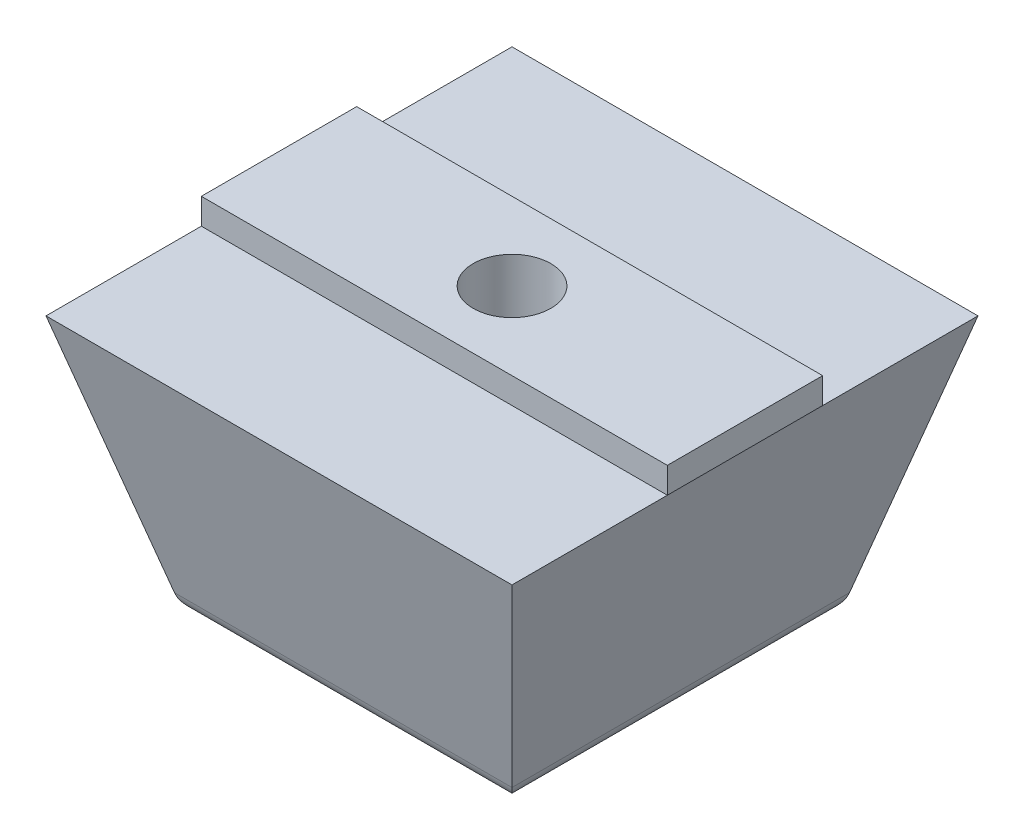
ISO-10303-21;
HEADER;
FILE_DESCRIPTION(('STEP AP214'),'2;1');
FILE_NAME('part.step','',(''),(''),'','','');
FILE_SCHEMA(('AUTOMOTIVE_DESIGN { 1 0 10303 214 1 1 1 1 }'));
ENDSEC;
DATA;
#1=APPLICATION_CONTEXT('core data for automotive mechanical design processes');
#2=APPLICATION_PROTOCOL_DEFINITION('international standard','automotive_design',2000,#1);
#3=PRODUCT_CONTEXT('',#1,'mechanical');
#4=PRODUCT('Part','Part','',(#3));
#5=PRODUCT_RELATED_PRODUCT_CATEGORY('part','',(#4));
#6=PRODUCT_DEFINITION_FORMATION('','',#4);
#7=PRODUCT_DEFINITION_CONTEXT('part definition',#1,'design');
#8=PRODUCT_DEFINITION('design','',#6,#7);
#9=PRODUCT_DEFINITION_SHAPE('','',#8);
#10=(LENGTH_UNIT() NAMED_UNIT(*) SI_UNIT(.MILLI.,.METRE.));
#11=(NAMED_UNIT(*) PLANE_ANGLE_UNIT() SI_UNIT($,.RADIAN.));
#12=(NAMED_UNIT(*) SI_UNIT($,.STERADIAN.) SOLID_ANGLE_UNIT());
#13=UNCERTAINTY_MEASURE_WITH_UNIT(LENGTH_MEASURE(1.E-05),#10,'distance_accuracy_value','');
#14=(GEOMETRIC_REPRESENTATION_CONTEXT(3) GLOBAL_UNCERTAINTY_ASSIGNED_CONTEXT((#13)) GLOBAL_UNIT_ASSIGNED_CONTEXT((#10,
#11,#12)) REPRESENTATION_CONTEXT('',''));
#15=CARTESIAN_POINT('',(0.,0.,0.));
#16=DIRECTION('',(0.,0.,1.));
#17=DIRECTION('',(1.,0.,0.));
#18=AXIS2_PLACEMENT_3D('',#15,#16,#17);
#19=CARTESIAN_POINT('',(0.,-10.001,0.));
#20=DIRECTION('',(0.,1.,0.));
#21=DIRECTION('',(0.,0.,1.));
#22=AXIS2_PLACEMENT_3D('',#19,#20,#21);
#23=CYLINDRICAL_SURFACE('',#22,1.5);
#24=CARTESIAN_POINT('',(0.,1.,0.));
#25=DIRECTION('',(0.,-1.,0.));
#26=DIRECTION('',(0.,0.,-1.));
#27=AXIS2_PLACEMENT_3D('',#24,#25,#26);
#28=CIRCLE('',#27,1.5);
#29=CARTESIAN_POINT('',(0.,1.,-1.5));
#30=VERTEX_POINT('',#29);
#31=EDGE_CURVE('E124',#30,#30,#28,.F.);
#32=ORIENTED_EDGE('',*,*,#31,.T.);
#33=EDGE_LOOP('',(#32));
#34=FACE_BOUND('',#33,.T.);
#35=CARTESIAN_POINT('',(0.,-2.,0.));
#36=DIRECTION('',(0.,-1.,0.));
#37=DIRECTION('',(0.,0.,-1.));
#38=AXIS2_PLACEMENT_3D('',#35,#36,#37);
#39=CIRCLE('',#38,1.5);
#40=CARTESIAN_POINT('',(0.,-2.,-1.5));
#41=VERTEX_POINT('',#40);
#42=EDGE_CURVE('E159',#41,#41,#39,.F.);
#43=ORIENTED_EDGE('',*,*,#42,.F.);
#44=EDGE_LOOP('',(#43));
#45=FACE_BOUND('',#44,.T.);
#46=ADVANCED_FACE('F36',(#34,#45),#23,.F.);
#47=CARTESIAN_POINT('',(0.,0.,0.));
#48=DIRECTION('',(0.,-1.,0.));
#49=DIRECTION('',(0.,0.,-1.));
#50=AXIS2_PLACEMENT_3D('',#47,#48,#49);
#51=PLANE('',#50);
#52=DIRECTION('',(1.,0.,0.));
#53=VECTOR('',#52,1.);
#54=CARTESIAN_POINT('',(-9.,0.,3.));
#55=LINE('',#54,#53);
#56=CARTESIAN_POINT('',(-9.,0.,3.));
#57=VERTEX_POINT('',#56);
#58=CARTESIAN_POINT('',(9.,0.,3.));
#59=VERTEX_POINT('',#58);
#60=EDGE_CURVE('E162',#57,#59,#55,.T.);
#61=ORIENTED_EDGE('',*,*,#60,.F.);
#62=DIRECTION('',(0.,0.,1.));
#63=VECTOR('',#62,1.);
#64=CARTESIAN_POINT('',(-9.,0.,9.));
#65=LINE('',#64,#63);
#66=CARTESIAN_POINT('',(-9.,0.,9.));
#67=VERTEX_POINT('',#66);
#68=EDGE_CURVE('E198',#57,#67,#65,.T.);
#69=ORIENTED_EDGE('',*,*,#68,.T.);
#70=DIRECTION('',(1.,0.,0.));
#71=VECTOR('',#70,1.);
#72=CARTESIAN_POINT('',(-9.,0.,9.));
#73=LINE('',#72,#71);
#74=CARTESIAN_POINT('',(9.,0.,9.));
#75=VERTEX_POINT('',#74);
#76=EDGE_CURVE('E191',#67,#75,#73,.T.);
#77=ORIENTED_EDGE('',*,*,#76,.T.);
#78=DIRECTION('',(0.,0.,-1.));
#79=VECTOR('',#78,1.);
#80=CARTESIAN_POINT('',(9.,0.,9.));
#81=LINE('',#80,#79);
#82=EDGE_CURVE('E142',#75,#59,#81,.T.);
#83=ORIENTED_EDGE('',*,*,#82,.T.);
#84=EDGE_LOOP('',(#61,#69,#77,#83));
#85=FACE_BOUND('',#84,.T.);
#86=ADVANCED_FACE('F269',(#85),#51,.F.);
#87=DIRECTION('',(-1.,0.,0.));
#88=VECTOR('',#87,1.);
#89=CARTESIAN_POINT('',(-9.,0.,-3.));
#90=LINE('',#89,#88);
#91=CARTESIAN_POINT('',(9.,0.,-3.));
#92=VERTEX_POINT('',#91);
#93=CARTESIAN_POINT('',(-9.,0.,-3.));
#94=VERTEX_POINT('',#93);
#95=EDGE_CURVE('E158',#92,#94,#90,.T.);
#96=ORIENTED_EDGE('',*,*,#95,.F.);
#97=CARTESIAN_POINT('',(9.,0.,-9.));
#98=VERTEX_POINT('',#97);
#99=EDGE_CURVE('E139',#92,#98,#81,.T.);
#100=ORIENTED_EDGE('',*,*,#99,.T.);
#101=DIRECTION('',(-1.,0.,0.));
#102=VECTOR('',#101,1.);
#103=CARTESIAN_POINT('',(-9.,0.,-9.));
#104=LINE('',#103,#102);
#105=CARTESIAN_POINT('',(-9.,0.,-9.));
#106=VERTEX_POINT('',#105);
#107=EDGE_CURVE('E177',#98,#106,#104,.T.);
#108=ORIENTED_EDGE('',*,*,#107,.T.);
#109=EDGE_CURVE('E194',#106,#94,#65,.T.);
#110=ORIENTED_EDGE('',*,*,#109,.T.);
#111=EDGE_LOOP('',(#96,#100,#108,#110));
#112=FACE_BOUND('',#111,.T.);
#113=ADVANCED_FACE('F211',(#112),#51,.F.);
#114=CARTESIAN_POINT('',(9.,0.,9.));
#115=DIRECTION('',(0.965925826289068,-0.258819045102521,0.));
#116=DIRECTION('',(0.258819045102521,0.965925826289068,0.));
#117=AXIS2_PLACEMENT_3D('',#114,#115,#116);
#118=PLANE('',#117);
#119=DIRECTION('',(0.250562807085732,0.935113126531029,0.250562807085732));
#120=VECTOR('',#119,1.);
#121=CARTESIAN_POINT('',(7.86992903469573,-4.21748225867394,7.86992903469573));
#122=LINE('',#121,#120);
#123=CARTESIAN_POINT('',(6.51910691399887,-9.25881904510252,6.51910691399887));
#124=VERTEX_POINT('',#123);
#125=EDGE_CURVE('E186',#124,#75,#122,.T.);
#126=ORIENTED_EDGE('',*,*,#125,.F.);
#127=DIRECTION('',(0.,0.,-1.));
#128=VECTOR('',#127,1.);
#129=CARTESIAN_POINT('',(6.51910691399887,-9.25881904510252,9.));
#130=LINE('',#129,#128);
#131=CARTESIAN_POINT('',(6.51910691399887,-9.25881904510252,-6.51910691399887));
#132=VERTEX_POINT('',#131);
#133=EDGE_CURVE('E150',#124,#132,#130,.T.);
#134=ORIENTED_EDGE('',*,*,#133,.T.);
#135=DIRECTION('',(0.250562807085732,0.935113126531029,-0.250562807085732));
#136=VECTOR('',#135,1.);
#137=CARTESIAN_POINT('',(7.86992903469573,-4.21748225867394,-7.86992903469573));
#138=LINE('',#137,#136);
#139=EDGE_CURVE('E189',#132,#98,#138,.T.);
#140=ORIENTED_EDGE('',*,*,#139,.T.);
#141=ORIENTED_EDGE('',*,*,#99,.F.);
#142=DIRECTION('',(0.,0.,-1.));
#143=VECTOR('',#142,1.);
#144=CARTESIAN_POINT('',(9.,0.,3.));
#145=LINE('',#144,#143);
#146=EDGE_CURVE('E138',#59,#92,#145,.T.);
#147=ORIENTED_EDGE('',*,*,#146,.F.);
#148=ORIENTED_EDGE('',*,*,#82,.F.);
#149=EDGE_LOOP('',(#126,#134,#140,#141,#147,#148));
#150=FACE_BOUND('',#149,.T.);
#151=ADVANCED_FACE('F221',(#150),#118,.T.);
#152=CARTESIAN_POINT('',(-9.,0.,9.));
#153=DIRECTION('',(0.,-0.258819045102521,0.965925826289068));
#154=DIRECTION('',(0.,-0.965925826289068,-0.258819045102521));
#155=AXIS2_PLACEMENT_3D('',#152,#153,#154);
#156=PLANE('',#155);
#157=DIRECTION('',(-0.250562807085732,0.935113126531029,0.250562807085732));
#158=VECTOR('',#157,1.);
#159=CARTESIAN_POINT('',(-9.,0.,9.));
#160=LINE('',#159,#158);
#161=CARTESIAN_POINT('',(-6.51910691399887,-9.25881904510252,6.51910691399887));
#162=VERTEX_POINT('',#161);
#163=EDGE_CURVE('E184',#162,#67,#160,.T.);
#164=ORIENTED_EDGE('',*,*,#163,.F.);
#165=DIRECTION('',(1.,0.,0.));
#166=VECTOR('',#165,1.);
#167=CARTESIAN_POINT('',(-9.,-9.25881904510252,6.51910691399887));
#168=LINE('',#167,#166);
#169=EDGE_CURVE('E12',#162,#124,#168,.T.);
#170=ORIENTED_EDGE('',*,*,#169,.T.);
#171=ORIENTED_EDGE('',*,*,#125,.T.);
#172=ORIENTED_EDGE('',*,*,#76,.F.);
#173=EDGE_LOOP('',(#164,#170,#171,#172));
#174=FACE_BOUND('',#173,.T.);
#175=ADVANCED_FACE('F298',(#174),#156,.T.);
#176=CARTESIAN_POINT('',(-9.,0.,9.));
#177=DIRECTION('',(-0.965925826289068,-0.258819045102521,0.));
#178=DIRECTION('',(0.258819045102521,-0.965925826289068,0.));
#179=AXIS2_PLACEMENT_3D('',#176,#177,#178);
#180=PLANE('',#179);
#181=DIRECTION('',(-0.250562807085732,0.935113126531029,-0.250562807085732));
#182=VECTOR('',#181,1.);
#183=CARTESIAN_POINT('',(-9.,0.,-9.));
#184=LINE('',#183,#182);
#185=CARTESIAN_POINT('',(-6.51910691399887,-9.25881904510252,-6.51910691399887));
#186=VERTEX_POINT('',#185);
#187=EDGE_CURVE('E187',#186,#106,#184,.T.);
#188=ORIENTED_EDGE('',*,*,#187,.F.);
#189=DIRECTION('',(0.,0.,1.));
#190=VECTOR('',#189,1.);
#191=CARTESIAN_POINT('',(-6.51910691399887,-9.25881904510252,9.));
#192=LINE('',#191,#190);
#193=EDGE_CURVE('E45',#186,#162,#192,.T.);
#194=ORIENTED_EDGE('',*,*,#193,.T.);
#195=ORIENTED_EDGE('',*,*,#163,.T.);
#196=ORIENTED_EDGE('',*,*,#68,.F.);
#197=DIRECTION('',(0.,0.,1.));
#198=VECTOR('',#197,1.);
#199=CARTESIAN_POINT('',(-9.,0.,3.));
#200=LINE('',#199,#198);
#201=EDGE_CURVE('E167',#94,#57,#200,.T.);
#202=ORIENTED_EDGE('',*,*,#201,.F.);
#203=ORIENTED_EDGE('',*,*,#109,.F.);
#204=EDGE_LOOP('',(#188,#194,#195,#196,#202,#203));
#205=FACE_BOUND('',#204,.T.);
#206=ADVANCED_FACE('F214',(#205),#180,.T.);
#207=CARTESIAN_POINT('',(-9.,0.,-9.));
#208=DIRECTION('',(0.,-0.258819045102521,-0.965925826289068));
#209=DIRECTION('',(0.,0.965925826289068,-0.258819045102521));
#210=AXIS2_PLACEMENT_3D('',#207,#208,#209);
#211=PLANE('',#210);
#212=ORIENTED_EDGE('',*,*,#139,.F.);
#213=DIRECTION('',(-1.,0.,0.));
#214=VECTOR('',#213,1.);
#215=CARTESIAN_POINT('',(-9.,-9.25881904510252,-6.51910691399887));
#216=LINE('',#215,#214);
#217=EDGE_CURVE('E60',#132,#186,#216,.T.);
#218=ORIENTED_EDGE('',*,*,#217,.T.);
#219=ORIENTED_EDGE('',*,*,#187,.T.);
#220=ORIENTED_EDGE('',*,*,#107,.F.);
#221=EDGE_LOOP('',(#212,#218,#219,#220));
#222=FACE_BOUND('',#221,.T.);
#223=ADVANCED_FACE('F213',(#222),#211,.T.);
#224=CARTESIAN_POINT('',(0.,-10.,0.));
#225=DIRECTION('',(0.,-1.,0.));
#226=DIRECTION('',(0.,0.,-1.));
#227=AXIS2_PLACEMENT_3D('',#224,#225,#226);
#228=PLANE('',#227);
#229=DIRECTION('',(-1.,0.,0.));
#230=VECTOR('',#229,1.);
#231=CARTESIAN_POINT('',(0.,-10.,-5.5531810877098));
#232=LINE('',#231,#230);
#233=CARTESIAN_POINT('',(-5.55318108770981,-10.,-5.5531810877098));
#234=VERTEX_POINT('',#233);
#235=CARTESIAN_POINT('',(5.55318108770981,-10.,-5.5531810877098));
#236=VERTEX_POINT('',#235);
#237=EDGE_CURVE('E233',#234,#236,#232,.F.);
#238=ORIENTED_EDGE('',*,*,#237,.T.);
#239=DIRECTION('',(0.,0.,-1.));
#240=VECTOR('',#239,1.);
#241=CARTESIAN_POINT('',(5.55318108770981,-10.,0.));
#242=LINE('',#241,#240);
#243=CARTESIAN_POINT('',(5.55318108770981,-10.,5.55318108770981));
#244=VERTEX_POINT('',#243);
#245=EDGE_CURVE('E237',#236,#244,#242,.F.);
#246=ORIENTED_EDGE('',*,*,#245,.T.);
#247=DIRECTION('',(1.,0.,0.));
#248=VECTOR('',#247,1.);
#249=CARTESIAN_POINT('',(0.,-10.,5.55318108770981));
#250=LINE('',#249,#248);
#251=CARTESIAN_POINT('',(-5.55318108770981,-10.,5.55318108770981));
#252=VERTEX_POINT('',#251);
#253=EDGE_CURVE('E227',#244,#252,#250,.F.);
#254=ORIENTED_EDGE('',*,*,#253,.T.);
#255=DIRECTION('',(0.,0.,1.));
#256=VECTOR('',#255,1.);
#257=CARTESIAN_POINT('',(-5.55318108770981,-10.,0.));
#258=LINE('',#257,#256);
#259=EDGE_CURVE('E228',#252,#234,#258,.F.);
#260=ORIENTED_EDGE('',*,*,#259,.T.);
#261=EDGE_LOOP('',(#238,#246,#254,#260));
#262=FACE_BOUND('',#261,.T.);
#263=CARTESIAN_POINT('',(0.,-10.,0.));
#264=DIRECTION('',(0.,-1.,0.));
#265=DIRECTION('',(0.,0.,-1.));
#266=AXIS2_PLACEMENT_3D('',#263,#264,#265);
#267=CIRCLE('',#266,3.);
#268=CARTESIAN_POINT('',(0.,-10.,-3.));
#269=VERTEX_POINT('',#268);
#270=EDGE_CURVE('E315',#269,#269,#267,.T.);
#271=ORIENTED_EDGE('',*,*,#270,.F.);
#272=EDGE_LOOP('',(#271));
#273=FACE_BOUND('',#272,.T.);
#274=ADVANCED_FACE('F255',(#262,#273),#228,.T.);
#275=CARTESIAN_POINT('',(9.,3.,3.));
#276=DIRECTION('',(-1.,0.,0.));
#277=DIRECTION('',(0.,0.,1.));
#278=AXIS2_PLACEMENT_3D('',#275,#276,#277);
#279=PLANE('',#278);
#280=DIRECTION('',(0.,-1.,0.));
#281=VECTOR('',#280,1.);
#282=CARTESIAN_POINT('',(9.,3.,-3.));
#283=LINE('',#282,#281);
#284=CARTESIAN_POINT('',(9.,1.,-3.));
#285=VERTEX_POINT('',#284);
#286=EDGE_CURVE('E131',#285,#92,#283,.T.);
#287=ORIENTED_EDGE('',*,*,#286,.F.);
#288=DIRECTION('',(0.,0.,1.));
#289=VECTOR('',#288,1.);
#290=CARTESIAN_POINT('',(9.,1.,3.));
#291=LINE('',#290,#289);
#292=CARTESIAN_POINT('',(9.,1.,3.));
#293=VERTEX_POINT('',#292);
#294=EDGE_CURVE('E113',#285,#293,#291,.T.);
#295=ORIENTED_EDGE('',*,*,#294,.T.);
#296=DIRECTION('',(0.,-1.,0.));
#297=VECTOR('',#296,1.);
#298=CARTESIAN_POINT('',(9.,3.,3.));
#299=LINE('',#298,#297);
#300=EDGE_CURVE('E166',#293,#59,#299,.T.);
#301=ORIENTED_EDGE('',*,*,#300,.T.);
#302=ORIENTED_EDGE('',*,*,#146,.T.);
#303=EDGE_LOOP('',(#287,#295,#301,#302));
#304=FACE_BOUND('',#303,.T.);
#305=ADVANCED_FACE('F136',(#304),#279,.F.);
#306=CARTESIAN_POINT('',(-9.,3.,-3.));
#307=DIRECTION('',(0.,0.,1.));
#308=DIRECTION('',(1.,0.,0.));
#309=AXIS2_PLACEMENT_3D('',#306,#307,#308);
#310=PLANE('',#309);
#311=DIRECTION('',(0.,-1.,0.));
#312=VECTOR('',#311,1.);
#313=CARTESIAN_POINT('',(-9.,3.,-3.));
#314=LINE('',#313,#312);
#315=CARTESIAN_POINT('',(-9.,1.,-3.));
#316=VERTEX_POINT('',#315);
#317=EDGE_CURVE('E133',#316,#94,#314,.T.);
#318=ORIENTED_EDGE('',*,*,#317,.F.);
#319=DIRECTION('',(-1.,0.,0.));
#320=VECTOR('',#319,1.);
#321=CARTESIAN_POINT('',(-10.,1.,-3.));
#322=LINE('',#321,#320);
#323=EDGE_CURVE('E117',#285,#316,#322,.T.);
#324=ORIENTED_EDGE('',*,*,#323,.F.);
#325=ORIENTED_EDGE('',*,*,#286,.T.);
#326=ORIENTED_EDGE('',*,*,#95,.T.);
#327=EDGE_LOOP('',(#318,#324,#325,#326));
#328=FACE_BOUND('',#327,.T.);
#329=ADVANCED_FACE('F129',(#328),#310,.F.);
#330=CARTESIAN_POINT('',(-9.,3.,3.));
#331=DIRECTION('',(1.,0.,0.));
#332=DIRECTION('',(0.,0.,-1.));
#333=AXIS2_PLACEMENT_3D('',#330,#331,#332);
#334=PLANE('',#333);
#335=DIRECTION('',(0.,-1.,0.));
#336=VECTOR('',#335,1.);
#337=CARTESIAN_POINT('',(-9.,3.,3.));
#338=LINE('',#337,#336);
#339=CARTESIAN_POINT('',(-9.,1.,3.));
#340=VERTEX_POINT('',#339);
#341=EDGE_CURVE('E144',#340,#57,#338,.T.);
#342=ORIENTED_EDGE('',*,*,#341,.F.);
#343=DIRECTION('',(0.,0.,-1.));
#344=VECTOR('',#343,1.);
#345=CARTESIAN_POINT('',(-9.,1.,3.));
#346=LINE('',#345,#344);
#347=EDGE_CURVE('E125',#340,#316,#346,.T.);
#348=ORIENTED_EDGE('',*,*,#347,.T.);
#349=ORIENTED_EDGE('',*,*,#317,.T.);
#350=ORIENTED_EDGE('',*,*,#201,.T.);
#351=EDGE_LOOP('',(#342,#348,#349,#350));
#352=FACE_BOUND('',#351,.T.);
#353=ADVANCED_FACE('F286',(#352),#334,.F.);
#354=CARTESIAN_POINT('',(-9.,3.,3.));
#355=DIRECTION('',(0.,0.,-1.));
#356=DIRECTION('',(-1.,0.,0.));
#357=AXIS2_PLACEMENT_3D('',#354,#355,#356);
#358=PLANE('',#357);
#359=ORIENTED_EDGE('',*,*,#300,.F.);
#360=DIRECTION('',(1.,0.,0.));
#361=VECTOR('',#360,1.);
#362=CARTESIAN_POINT('',(-10.,1.,3.));
#363=LINE('',#362,#361);
#364=EDGE_CURVE('E120',#340,#293,#363,.T.);
#365=ORIENTED_EDGE('',*,*,#364,.F.);
#366=ORIENTED_EDGE('',*,*,#341,.T.);
#367=ORIENTED_EDGE('',*,*,#60,.T.);
#368=EDGE_LOOP('',(#359,#365,#366,#367));
#369=FACE_BOUND('',#368,.T.);
#370=ADVANCED_FACE('F282',(#369),#358,.F.);
#371=CARTESIAN_POINT('',(0.,-2.,0.));
#372=DIRECTION('',(0.,-1.,0.));
#373=DIRECTION('',(0.,0.,-1.));
#374=AXIS2_PLACEMENT_3D('',#371,#372,#373);
#375=PLANE('',#374);
#376=CARTESIAN_POINT('',(0.,-2.,0.));
#377=DIRECTION('',(0.,-1.,0.));
#378=DIRECTION('',(0.,0.,-1.));
#379=AXIS2_PLACEMENT_3D('',#376,#377,#378);
#380=CIRCLE('',#379,3.);
#381=CARTESIAN_POINT('',(0.,-2.,-3.));
#382=VERTEX_POINT('',#381);
#383=EDGE_CURVE('E311',#382,#382,#380,.F.);
#384=ORIENTED_EDGE('',*,*,#383,.F.);
#385=EDGE_LOOP('',(#384));
#386=FACE_BOUND('',#385,.T.);
#387=ORIENTED_EDGE('',*,*,#42,.T.);
#388=EDGE_LOOP('',(#387));
#389=FACE_BOUND('',#388,.T.);
#390=ADVANCED_FACE('F285',(#386,#389),#375,.T.);
#391=CARTESIAN_POINT('',(0.,8.48528137423857,0.));
#392=DIRECTION('',(0.,-1.,0.));
#393=DIRECTION('',(0.,0.,-1.));
#394=AXIS2_PLACEMENT_3D('',#391,#392,#393);
#395=CYLINDRICAL_SURFACE('',#394,3.);
#396=ORIENTED_EDGE('',*,*,#383,.T.);
#397=EDGE_LOOP('',(#396));
#398=FACE_BOUND('',#397,.T.);
#399=ORIENTED_EDGE('',*,*,#270,.T.);
#400=EDGE_LOOP('',(#399));
#401=FACE_BOUND('',#400,.T.);
#402=ADVANCED_FACE('F280',(#398,#401),#395,.F.);
#403=CARTESIAN_POINT('',(0.,1.,0.));
#404=DIRECTION('',(0.,-1.,0.));
#405=DIRECTION('',(0.,0.,-1.));
#406=AXIS2_PLACEMENT_3D('',#403,#404,#405);
#407=PLANE('',#406);
#408=ORIENTED_EDGE('',*,*,#323,.T.);
#409=ORIENTED_EDGE('',*,*,#347,.F.);
#410=ORIENTED_EDGE('',*,*,#364,.T.);
#411=ORIENTED_EDGE('',*,*,#294,.F.);
#412=EDGE_LOOP('',(#408,#409,#410,#411));
#413=FACE_BOUND('',#412,.T.);
#414=ORIENTED_EDGE('',*,*,#31,.F.);
#415=EDGE_LOOP('',(#414));
#416=FACE_BOUND('',#415,.T.);
#417=ADVANCED_FACE('F115',(#413,#416),#407,.F.);
#418=CARTESIAN_POINT('',(-5.55318108770981,-9.,9.));
#419=DIRECTION('',(0.,0.,1.));
#420=DIRECTION('',(1.,0.,0.));
#421=AXIS2_PLACEMENT_3D('',#418,#419,#420);
#422=CYLINDRICAL_SURFACE('',#421,1.);
#423=CARTESIAN_POINT('',(-5.55318108770981,-9.,-5.55318108770981));
#424=DIRECTION('',(-0.707106781186547,0.,0.707106781186547));
#425=DIRECTION('',(0.707106781186547,0.,0.707106781186547));
#426=AXIS2_PLACEMENT_3D('',#423,#424,#425);
#427=ELLIPSE('',#426,1.41421356237309,1.);
#428=EDGE_CURVE('E244',#234,#186,#427,.F.);
#429=ORIENTED_EDGE('',*,*,#428,.F.);
#430=ORIENTED_EDGE('',*,*,#259,.F.);
#431=CARTESIAN_POINT('',(-5.55318108770981,-9.,5.55318108770981));
#432=DIRECTION('',(0.707106781186547,0.,0.707106781186547));
#433=DIRECTION('',(0.707106781186547,0.,-0.707106781186547));
#434=AXIS2_PLACEMENT_3D('',#431,#432,#433);
#435=ELLIPSE('',#434,1.41421356237309,1.);
#436=EDGE_CURVE('E40',#162,#252,#435,.T.);
#437=ORIENTED_EDGE('',*,*,#436,.F.);
#438=ORIENTED_EDGE('',*,*,#193,.F.);
#439=EDGE_LOOP('',(#429,#430,#437,#438));
#440=FACE_BOUND('',#439,.T.);
#441=ADVANCED_FACE('F38',(#440),#422,.T.);
#442=CARTESIAN_POINT('',(-9.,-9.,5.55318108770981));
#443=DIRECTION('',(1.,0.,0.));
#444=DIRECTION('',(0.,0.,-1.));
#445=AXIS2_PLACEMENT_3D('',#442,#443,#444);
#446=CYLINDRICAL_SURFACE('',#445,1.);
#447=ORIENTED_EDGE('',*,*,#436,.T.);
#448=ORIENTED_EDGE('',*,*,#253,.F.);
#449=CARTESIAN_POINT('',(5.55318108770981,-9.,5.55318108770981));
#450=DIRECTION('',(0.707106781186547,0.,-0.707106781186547));
#451=DIRECTION('',(0.707106781186547,0.,0.707106781186547));
#452=AXIS2_PLACEMENT_3D('',#449,#450,#451);
#453=ELLIPSE('',#452,1.41421356237309,1.);
#454=EDGE_CURVE('E243',#124,#244,#453,.T.);
#455=ORIENTED_EDGE('',*,*,#454,.F.);
#456=ORIENTED_EDGE('',*,*,#169,.F.);
#457=EDGE_LOOP('',(#447,#448,#455,#456));
#458=FACE_BOUND('',#457,.T.);
#459=ADVANCED_FACE('F253',(#458),#446,.T.);
#460=CARTESIAN_POINT('',(-9.,-9.,-5.5531810877098));
#461=DIRECTION('',(-1.,0.,0.));
#462=DIRECTION('',(0.,0.,1.));
#463=AXIS2_PLACEMENT_3D('',#460,#461,#462);
#464=CYLINDRICAL_SURFACE('',#463,1.);
#465=ORIENTED_EDGE('',*,*,#428,.T.);
#466=ORIENTED_EDGE('',*,*,#217,.F.);
#467=CARTESIAN_POINT('',(5.55318108770981,-9.,-5.5531810877098));
#468=DIRECTION('',(-0.707106781186547,0.,-0.707106781186547));
#469=DIRECTION('',(-0.707106781186547,0.,0.707106781186547));
#470=AXIS2_PLACEMENT_3D('',#467,#468,#469);
#471=ELLIPSE('',#470,1.41421356237309,1.);
#472=EDGE_CURVE('E241',#236,#132,#471,.F.);
#473=ORIENTED_EDGE('',*,*,#472,.F.);
#474=ORIENTED_EDGE('',*,*,#237,.F.);
#475=EDGE_LOOP('',(#465,#466,#473,#474));
#476=FACE_BOUND('',#475,.T.);
#477=ADVANCED_FACE('F260',(#476),#464,.T.);
#478=CARTESIAN_POINT('',(5.55318108770981,-9.,9.));
#479=DIRECTION('',(0.,0.,-1.));
#480=DIRECTION('',(-1.,0.,0.));
#481=AXIS2_PLACEMENT_3D('',#478,#479,#480);
#482=CYLINDRICAL_SURFACE('',#481,1.);
#483=ORIENTED_EDGE('',*,*,#454,.T.);
#484=ORIENTED_EDGE('',*,*,#245,.F.);
#485=ORIENTED_EDGE('',*,*,#472,.T.);
#486=ORIENTED_EDGE('',*,*,#133,.F.);
#487=EDGE_LOOP('',(#483,#484,#485,#486));
#488=FACE_BOUND('',#487,.T.);
#489=ADVANCED_FACE('F259',(#488),#482,.T.);
#490=CLOSED_SHELL('',(#46,#86,#113,#151,#175,#206,#223,#274,#305,#329,#353,#370,#390,#402,#417,
#441,#459,#477,#489));
#491=MANIFOLD_SOLID_BREP('B2',#490);
#492=ADVANCED_BREP_SHAPE_REPRESENTATION('',(#18,#491),#14);
#493=SHAPE_DEFINITION_REPRESENTATION(#9,#492);
ENDSEC;
END-ISO-10303-21;
